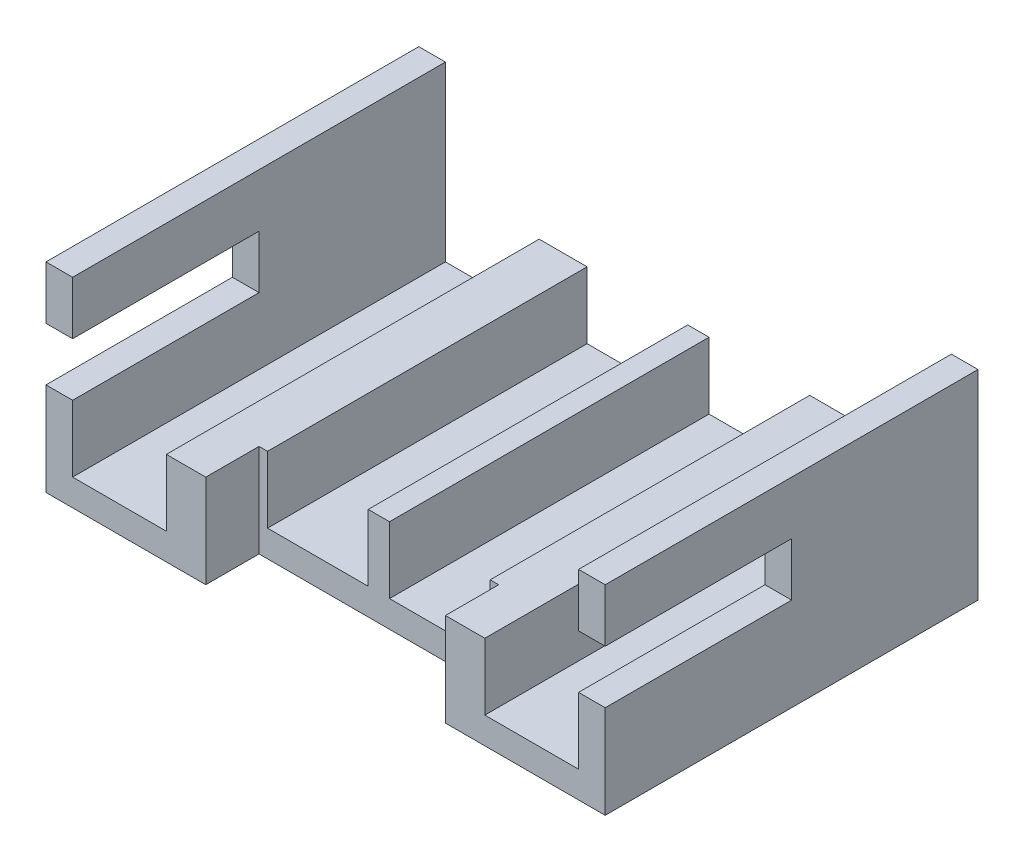
ISO-10303-21;
HEADER;
FILE_DESCRIPTION(('STEP AP214'),'2;1');
FILE_NAME('part.step','',(''),(''),'','','');
FILE_SCHEMA(('AUTOMOTIVE_DESIGN { 1 0 10303 214 1 1 1 1 }'));
ENDSEC;
DATA;
#1=APPLICATION_CONTEXT('core data for automotive mechanical design processes');
#2=APPLICATION_PROTOCOL_DEFINITION('international standard','automotive_design',2000,#1);
#3=PRODUCT_CONTEXT('',#1,'mechanical');
#4=PRODUCT('Part','Part','',(#3));
#5=PRODUCT_RELATED_PRODUCT_CATEGORY('part','',(#4));
#6=PRODUCT_DEFINITION_FORMATION('','',#4);
#7=PRODUCT_DEFINITION_CONTEXT('part definition',#1,'design');
#8=PRODUCT_DEFINITION('design','',#6,#7);
#9=PRODUCT_DEFINITION_SHAPE('','',#8);
#10=(LENGTH_UNIT() NAMED_UNIT(*) SI_UNIT(.MILLI.,.METRE.));
#11=(NAMED_UNIT(*) PLANE_ANGLE_UNIT() SI_UNIT($,.RADIAN.));
#12=(NAMED_UNIT(*) SI_UNIT($,.STERADIAN.) SOLID_ANGLE_UNIT());
#13=UNCERTAINTY_MEASURE_WITH_UNIT(LENGTH_MEASURE(1.E-05),#10,'distance_accuracy_value','');
#14=(GEOMETRIC_REPRESENTATION_CONTEXT(3) GLOBAL_UNCERTAINTY_ASSIGNED_CONTEXT((#13)) GLOBAL_UNIT_ASSIGNED_CONTEXT((#10,
#11,#12)) REPRESENTATION_CONTEXT('',''));
#15=CARTESIAN_POINT('',(0.,0.,0.));
#16=DIRECTION('',(0.,0.,1.));
#17=DIRECTION('',(1.,0.,0.));
#18=AXIS2_PLACEMENT_3D('',#15,#16,#17);
#19=CARTESIAN_POINT('',(-2.09,1.75,8.96786686541544));
#20=DIRECTION('',(0.,-1.,0.));
#21=DIRECTION('',(1.,0.,0.));
#22=AXIS2_PLACEMENT_3D('',#19,#20,#21);
#23=PLANE('',#22);
#24=DIRECTION('',(1.,0.,0.));
#25=VECTOR('',#24,1.);
#26=CARTESIAN_POINT('',(-2.09,1.75,0.));
#27=LINE('',#26,#25);
#28=CARTESIAN_POINT('',(-2.99,1.75,0.));
#29=VERTEX_POINT('',#28);
#30=CARTESIAN_POINT('',(-2.09,1.75,0.));
#31=VERTEX_POINT('',#30);
#32=EDGE_CURVE('E288',#29,#31,#27,.T.);
#33=ORIENTED_EDGE('',*,*,#32,.F.);
#34=DIRECTION('',(0.,0.,1.));
#35=VECTOR('',#34,1.);
#36=CARTESIAN_POINT('',(-2.99,1.75,8.96786686541544));
#37=LINE('',#36,#35);
#38=CARTESIAN_POINT('',(-2.99,1.75,7.));
#39=VERTEX_POINT('',#38);
#40=EDGE_CURVE('E261',#39,#29,#37,.F.);
#41=ORIENTED_EDGE('',*,*,#40,.F.);
#42=DIRECTION('',(1.,0.,0.));
#43=VECTOR('',#42,1.);
#44=CARTESIAN_POINT('',(-2.09,1.75,7.));
#45=LINE('',#44,#43);
#46=CARTESIAN_POINT('',(-2.25,1.75,7.));
#47=VERTEX_POINT('',#46);
#48=EDGE_CURVE('E224',#47,#39,#45,.F.);
#49=ORIENTED_EDGE('',*,*,#48,.F.);
#50=DIRECTION('',(0.,0.,1.));
#51=VECTOR('',#50,1.);
#52=CARTESIAN_POINT('',(-2.25,1.75,8.96786686541544));
#53=LINE('',#52,#51);
#54=CARTESIAN_POINT('',(-2.25,1.75,6.));
#55=VERTEX_POINT('',#54);
#56=EDGE_CURVE('E227',#55,#47,#53,.T.);
#57=ORIENTED_EDGE('',*,*,#56,.F.);
#58=DIRECTION('',(1.,0.,0.));
#59=VECTOR('',#58,1.);
#60=CARTESIAN_POINT('',(-2.09,1.75,6.));
#61=LINE('',#60,#59);
#62=CARTESIAN_POINT('',(-2.09,1.75,6.));
#63=VERTEX_POINT('',#62);
#64=EDGE_CURVE('E20',#63,#55,#61,.F.);
#65=ORIENTED_EDGE('',*,*,#64,.F.);
#66=DIRECTION('',(0.,0.,1.));
#67=VECTOR('',#66,1.);
#68=CARTESIAN_POINT('',(-2.09,1.75,8.96786686541544));
#69=LINE('',#68,#67);
#70=EDGE_CURVE('E246',#63,#31,#69,.F.);
#71=ORIENTED_EDGE('',*,*,#70,.T.);
#72=EDGE_LOOP('',(#33,#41,#49,#57,#65,#71));
#73=FACE_BOUND('',#72,.T.);
#74=ADVANCED_FACE('F17',(#73),#23,.F.);
#75=CARTESIAN_POINT('',(2.09,1.75,8.96786686541544));
#76=DIRECTION('',(0.,1.,0.));
#77=DIRECTION('',(-1.,0.,0.));
#78=AXIS2_PLACEMENT_3D('',#75,#76,#77);
#79=PLANE('',#78);
#80=DIRECTION('',(0.,0.,1.));
#81=VECTOR('',#80,1.);
#82=CARTESIAN_POINT('',(2.25,1.75,8.96786686541544));
#83=LINE('',#82,#81);
#84=CARTESIAN_POINT('',(2.25,1.75,6.));
#85=VERTEX_POINT('',#84);
#86=CARTESIAN_POINT('',(2.25,1.75,7.));
#87=VERTEX_POINT('',#86);
#88=EDGE_CURVE('E282',#85,#87,#83,.T.);
#89=ORIENTED_EDGE('',*,*,#88,.T.);
#90=DIRECTION('',(-1.,0.,0.));
#91=VECTOR('',#90,1.);
#92=CARTESIAN_POINT('',(2.09,1.75,7.));
#93=LINE('',#92,#91);
#94=CARTESIAN_POINT('',(2.99,1.75,7.));
#95=VERTEX_POINT('',#94);
#96=EDGE_CURVE('E280',#87,#95,#93,.F.);
#97=ORIENTED_EDGE('',*,*,#96,.T.);
#98=DIRECTION('',(0.,0.,1.));
#99=VECTOR('',#98,1.);
#100=CARTESIAN_POINT('',(2.99,1.75,8.96786686541544));
#101=LINE('',#100,#99);
#102=CARTESIAN_POINT('',(2.99,1.75,0.));
#103=VERTEX_POINT('',#102);
#104=EDGE_CURVE('E270',#95,#103,#101,.F.);
#105=ORIENTED_EDGE('',*,*,#104,.T.);
#106=DIRECTION('',(-1.,0.,0.));
#107=VECTOR('',#106,1.);
#108=CARTESIAN_POINT('',(2.09,1.75,0.));
#109=LINE('',#108,#107);
#110=CARTESIAN_POINT('',(2.09,1.75,0.));
#111=VERTEX_POINT('',#110);
#112=EDGE_CURVE('E286',#103,#111,#109,.T.);
#113=ORIENTED_EDGE('',*,*,#112,.T.);
#114=DIRECTION('',(0.,0.,1.));
#115=VECTOR('',#114,1.);
#116=CARTESIAN_POINT('',(2.09,1.75,8.96786686541544));
#117=LINE('',#116,#115);
#118=CARTESIAN_POINT('',(2.09,1.75,6.));
#119=VERTEX_POINT('',#118);
#120=EDGE_CURVE('E449',#119,#111,#117,.F.);
#121=ORIENTED_EDGE('',*,*,#120,.F.);
#122=DIRECTION('',(-1.,0.,0.));
#123=VECTOR('',#122,1.);
#124=CARTESIAN_POINT('',(2.09,1.75,6.));
#125=LINE('',#124,#123);
#126=EDGE_CURVE('E284',#119,#85,#125,.F.);
#127=ORIENTED_EDGE('',*,*,#126,.T.);
#128=EDGE_LOOP('',(#89,#97,#105,#113,#121,#127));
#129=FACE_BOUND('',#128,.T.);
#130=ADVANCED_FACE('F463',(#129),#79,.T.);
#131=CARTESIAN_POINT('',(-0.2,1.75,8.79513230710162));
#132=DIRECTION('',(0.,1.,0.));
#133=DIRECTION('',(0.,0.,1.));
#134=AXIS2_PLACEMENT_3D('',#131,#132,#133);
#135=PLANE('',#134);
#136=DIRECTION('',(0.,0.,1.));
#137=VECTOR('',#136,1.);
#138=CARTESIAN_POINT('',(-0.2,1.75,8.79513230710162));
#139=LINE('',#138,#137);
#140=CARTESIAN_POINT('',(-0.2,1.75,6.));
#141=VERTEX_POINT('',#140);
#142=CARTESIAN_POINT('',(-0.2,1.75,0.));
#143=VERTEX_POINT('',#142);
#144=EDGE_CURVE('E256',#141,#143,#139,.F.);
#145=ORIENTED_EDGE('',*,*,#144,.F.);
#146=DIRECTION('',(1.,0.,0.));
#147=VECTOR('',#146,1.);
#148=CARTESIAN_POINT('',(-0.2,1.75,6.));
#149=LINE('',#148,#147);
#150=CARTESIAN_POINT('',(0.2,1.75,6.));
#151=VERTEX_POINT('',#150);
#152=EDGE_CURVE('E276',#141,#151,#149,.T.);
#153=ORIENTED_EDGE('',*,*,#152,.T.);
#154=DIRECTION('',(0.,0.,1.));
#155=VECTOR('',#154,1.);
#156=CARTESIAN_POINT('',(0.2,1.75,8.79513230710162));
#157=LINE('',#156,#155);
#158=CARTESIAN_POINT('',(0.2,1.75,0.));
#159=VERTEX_POINT('',#158);
#160=EDGE_CURVE('E439',#151,#159,#157,.F.);
#161=ORIENTED_EDGE('',*,*,#160,.T.);
#162=DIRECTION('',(1.,0.,0.));
#163=VECTOR('',#162,1.);
#164=CARTESIAN_POINT('',(-0.2,1.75,0.));
#165=LINE('',#164,#163);
#166=EDGE_CURVE('E278',#159,#143,#165,.F.);
#167=ORIENTED_EDGE('',*,*,#166,.T.);
#168=EDGE_LOOP('',(#145,#153,#161,#167));
#169=FACE_BOUND('',#168,.T.);
#170=ADVANCED_FACE('F813',(#169),#135,.T.);
#171=CARTESIAN_POINT('',(2.99,0.,8.96786686541544));
#172=DIRECTION('',(-1.,0.,0.));
#173=DIRECTION('',(0.,-1.,0.));
#174=AXIS2_PLACEMENT_3D('',#171,#172,#173);
#175=PLANE('',#174);
#176=DIRECTION('',(0.,-1.,0.));
#177=VECTOR('',#176,1.);
#178=CARTESIAN_POINT('',(2.99,0.,0.));
#179=LINE('',#178,#177);
#180=CARTESIAN_POINT('',(2.99,0.5,0.));
#181=VERTEX_POINT('',#180);
#182=EDGE_CURVE('E268',#103,#181,#179,.T.);
#183=ORIENTED_EDGE('',*,*,#182,.F.);
#184=ORIENTED_EDGE('',*,*,#104,.F.);
#185=DIRECTION('',(0.,-1.,0.));
#186=VECTOR('',#185,1.);
#187=CARTESIAN_POINT('',(2.99,0.,7.));
#188=LINE('',#187,#186);
#189=CARTESIAN_POINT('',(2.99,0.5,7.));
#190=VERTEX_POINT('',#189);
#191=EDGE_CURVE('E273',#190,#95,#188,.F.);
#192=ORIENTED_EDGE('',*,*,#191,.F.);
#193=DIRECTION('',(0.,0.,1.));
#194=VECTOR('',#193,1.);
#195=CARTESIAN_POINT('',(2.99,0.500000000000001,7.));
#196=LINE('',#195,#194);
#197=EDGE_CURVE('E424',#181,#190,#196,.T.);
#198=ORIENTED_EDGE('',*,*,#197,.F.);
#199=EDGE_LOOP('',(#183,#184,#192,#198));
#200=FACE_BOUND('',#199,.T.);
#201=ADVANCED_FACE('F468',(#200),#175,.F.);
#202=CARTESIAN_POINT('',(-2.99,0.,8.96786686541544));
#203=DIRECTION('',(-1.,0.,0.));
#204=DIRECTION('',(0.,-1.,0.));
#205=AXIS2_PLACEMENT_3D('',#202,#203,#204);
#206=PLANE('',#205);
#207=DIRECTION('',(0.,-1.,0.));
#208=VECTOR('',#207,1.);
#209=CARTESIAN_POINT('',(-2.99,0.,7.));
#210=LINE('',#209,#208);
#211=CARTESIAN_POINT('',(-2.99,0.5,7.));
#212=VERTEX_POINT('',#211);
#213=EDGE_CURVE('E264',#212,#39,#210,.F.);
#214=ORIENTED_EDGE('',*,*,#213,.T.);
#215=ORIENTED_EDGE('',*,*,#40,.T.);
#216=DIRECTION('',(0.,-1.,0.));
#217=VECTOR('',#216,1.);
#218=CARTESIAN_POINT('',(-2.99,0.,0.));
#219=LINE('',#218,#217);
#220=CARTESIAN_POINT('',(-2.99,0.5,0.));
#221=VERTEX_POINT('',#220);
#222=EDGE_CURVE('E266',#29,#221,#219,.T.);
#223=ORIENTED_EDGE('',*,*,#222,.T.);
#224=DIRECTION('',(0.,0.,1.));
#225=VECTOR('',#224,1.);
#226=CARTESIAN_POINT('',(-2.99,0.5,7.));
#227=LINE('',#226,#225);
#228=EDGE_CURVE('E380',#212,#221,#227,.F.);
#229=ORIENTED_EDGE('',*,*,#228,.F.);
#230=EDGE_LOOP('',(#214,#215,#223,#229));
#231=FACE_BOUND('',#230,.T.);
#232=ADVANCED_FACE('F299',(#231),#206,.T.);
#233=CARTESIAN_POINT('',(-0.2,0.,8.79513230710162));
#234=DIRECTION('',(-1.,0.,0.));
#235=DIRECTION('',(0.,0.,1.));
#236=AXIS2_PLACEMENT_3D('',#233,#234,#235);
#237=PLANE('',#236);
#238=DIRECTION('',(0.,1.,0.));
#239=VECTOR('',#238,1.);
#240=CARTESIAN_POINT('',(-0.2,0.,0.));
#241=LINE('',#240,#239);
#242=CARTESIAN_POINT('',(-0.2,0.5,0.));
#243=VERTEX_POINT('',#242);
#244=EDGE_CURVE('E251',#143,#243,#241,.F.);
#245=ORIENTED_EDGE('',*,*,#244,.T.);
#246=DIRECTION('',(0.,0.,1.));
#247=VECTOR('',#246,1.);
#248=CARTESIAN_POINT('',(-0.2,0.5,7.));
#249=LINE('',#248,#247);
#250=CARTESIAN_POINT('',(-0.2,0.5,6.));
#251=VERTEX_POINT('',#250);
#252=EDGE_CURVE('E372',#251,#243,#249,.F.);
#253=ORIENTED_EDGE('',*,*,#252,.F.);
#254=DIRECTION('',(0.,1.,0.));
#255=VECTOR('',#254,1.);
#256=CARTESIAN_POINT('',(-0.2,0.,6.));
#257=LINE('',#256,#255);
#258=EDGE_CURVE('E259',#251,#141,#257,.T.);
#259=ORIENTED_EDGE('',*,*,#258,.T.);
#260=ORIENTED_EDGE('',*,*,#144,.T.);
#261=EDGE_LOOP('',(#245,#253,#259,#260));
#262=FACE_BOUND('',#261,.T.);
#263=ADVANCED_FACE('F790',(#262),#237,.T.);
#264=CARTESIAN_POINT('',(-2.09,0.,8.96786686541544));
#265=DIRECTION('',(-1.,0.,0.));
#266=DIRECTION('',(0.,-1.,0.));
#267=AXIS2_PLACEMENT_3D('',#264,#265,#266);
#268=PLANE('',#267);
#269=DIRECTION('',(0.,-1.,0.));
#270=VECTOR('',#269,1.);
#271=CARTESIAN_POINT('',(-2.09,0.,6.));
#272=LINE('',#271,#270);
#273=CARTESIAN_POINT('',(-2.09,0.5,6.));
#274=VERTEX_POINT('',#273);
#275=EDGE_CURVE('E241',#274,#63,#272,.F.);
#276=ORIENTED_EDGE('',*,*,#275,.F.);
#277=DIRECTION('',(0.,0.,1.));
#278=VECTOR('',#277,1.);
#279=CARTESIAN_POINT('',(-2.09,0.5,7.));
#280=LINE('',#279,#278);
#281=CARTESIAN_POINT('',(-2.09,0.5,0.));
#282=VERTEX_POINT('',#281);
#283=EDGE_CURVE('E370',#282,#274,#280,.T.);
#284=ORIENTED_EDGE('',*,*,#283,.F.);
#285=DIRECTION('',(0.,-1.,0.));
#286=VECTOR('',#285,1.);
#287=CARTESIAN_POINT('',(-2.09,0.,0.));
#288=LINE('',#287,#286);
#289=EDGE_CURVE('E247',#31,#282,#288,.T.);
#290=ORIENTED_EDGE('',*,*,#289,.F.);
#291=ORIENTED_EDGE('',*,*,#70,.F.);
#292=EDGE_LOOP('',(#276,#284,#290,#291));
#293=FACE_BOUND('',#292,.T.);
#294=ADVANCED_FACE('F782',(#293),#268,.F.);
#295=CARTESIAN_POINT('',(2.09,0.,8.96786686541544));
#296=DIRECTION('',(-1.,0.,0.));
#297=DIRECTION('',(0.,-1.,0.));
#298=AXIS2_PLACEMENT_3D('',#295,#296,#297);
#299=PLANE('',#298);
#300=DIRECTION('',(0.,-1.,0.));
#301=VECTOR('',#300,1.);
#302=CARTESIAN_POINT('',(2.09,0.,0.));
#303=LINE('',#302,#301);
#304=CARTESIAN_POINT('',(2.09,0.5,0.));
#305=VERTEX_POINT('',#304);
#306=EDGE_CURVE('E447',#111,#305,#303,.T.);
#307=ORIENTED_EDGE('',*,*,#306,.T.);
#308=DIRECTION('',(0.,0.,1.));
#309=VECTOR('',#308,1.);
#310=CARTESIAN_POINT('',(2.09,0.5,7.));
#311=LINE('',#310,#309);
#312=CARTESIAN_POINT('',(2.09,0.5,6.));
#313=VERTEX_POINT('',#312);
#314=EDGE_CURVE('E367',#313,#305,#311,.F.);
#315=ORIENTED_EDGE('',*,*,#314,.F.);
#316=DIRECTION('',(0.,-1.,0.));
#317=VECTOR('',#316,1.);
#318=CARTESIAN_POINT('',(2.09,0.,6.));
#319=LINE('',#318,#317);
#320=EDGE_CURVE('E249',#313,#119,#319,.F.);
#321=ORIENTED_EDGE('',*,*,#320,.T.);
#322=ORIENTED_EDGE('',*,*,#120,.T.);
#323=EDGE_LOOP('',(#307,#315,#321,#322));
#324=FACE_BOUND('',#323,.T.);
#325=ADVANCED_FACE('F454',(#324),#299,.T.);
#326=CARTESIAN_POINT('',(0.2,0.,8.79513230710162));
#327=DIRECTION('',(-1.,0.,0.));
#328=DIRECTION('',(0.,0.,1.));
#329=AXIS2_PLACEMENT_3D('',#326,#327,#328);
#330=PLANE('',#329);
#331=DIRECTION('',(0.,1.,0.));
#332=VECTOR('',#331,1.);
#333=CARTESIAN_POINT('',(0.2,0.,6.));
#334=LINE('',#333,#332);
#335=CARTESIAN_POINT('',(0.2,0.5,6.));
#336=VERTEX_POINT('',#335);
#337=EDGE_CURVE('E442',#336,#151,#334,.T.);
#338=ORIENTED_EDGE('',*,*,#337,.F.);
#339=DIRECTION('',(0.,0.,1.));
#340=VECTOR('',#339,1.);
#341=CARTESIAN_POINT('',(0.2,0.5,7.));
#342=LINE('',#341,#340);
#343=CARTESIAN_POINT('',(0.2,0.5,0.));
#344=VERTEX_POINT('',#343);
#345=EDGE_CURVE('E364',#344,#336,#342,.T.);
#346=ORIENTED_EDGE('',*,*,#345,.F.);
#347=DIRECTION('',(0.,1.,0.));
#348=VECTOR('',#347,1.);
#349=CARTESIAN_POINT('',(0.2,0.,0.));
#350=LINE('',#349,#348);
#351=EDGE_CURVE('E445',#159,#344,#350,.F.);
#352=ORIENTED_EDGE('',*,*,#351,.F.);
#353=ORIENTED_EDGE('',*,*,#160,.F.);
#354=EDGE_LOOP('',(#338,#346,#352,#353));
#355=FACE_BOUND('',#354,.T.);
#356=ADVANCED_FACE('F766',(#355),#330,.F.);
#357=CARTESIAN_POINT('',(4.75,3.75,7.));
#358=DIRECTION('',(0.,1.,0.));
#359=DIRECTION('',(0.,0.,1.));
#360=AXIS2_PLACEMENT_3D('',#357,#358,#359);
#361=PLANE('',#360);
#362=DIRECTION('',(-1.,0.,0.));
#363=VECTOR('',#362,1.);
#364=CARTESIAN_POINT('',(5.25,3.75,7.));
#365=LINE('',#364,#363);
#366=CARTESIAN_POINT('',(4.75,3.75,7.));
#367=VERTEX_POINT('',#366);
#368=CARTESIAN_POINT('',(5.25,3.75,7.));
#369=VERTEX_POINT('',#368);
#370=EDGE_CURVE('E430',#367,#369,#365,.F.);
#371=ORIENTED_EDGE('',*,*,#370,.T.);
#372=DIRECTION('',(0.,0.,1.));
#373=VECTOR('',#372,1.);
#374=CARTESIAN_POINT('',(5.25,3.75,7.));
#375=LINE('',#374,#373);
#376=CARTESIAN_POINT('',(5.25,3.75,0.));
#377=VERTEX_POINT('',#376);
#378=EDGE_CURVE('E350',#369,#377,#375,.F.);
#379=ORIENTED_EDGE('',*,*,#378,.T.);
#380=DIRECTION('',(1.,0.,0.));
#381=VECTOR('',#380,1.);
#382=CARTESIAN_POINT('',(4.75,3.75,0.));
#383=LINE('',#382,#381);
#384=CARTESIAN_POINT('',(4.75,3.75,0.));
#385=VERTEX_POINT('',#384);
#386=EDGE_CURVE('E437',#377,#385,#383,.F.);
#387=ORIENTED_EDGE('',*,*,#386,.T.);
#388=DIRECTION('',(0.,0.,1.));
#389=VECTOR('',#388,1.);
#390=CARTESIAN_POINT('',(4.75,3.75,7.));
#391=LINE('',#390,#389);
#392=EDGE_CURVE('E416',#367,#385,#391,.F.);
#393=ORIENTED_EDGE('',*,*,#392,.F.);
#394=EDGE_LOOP('',(#371,#379,#387,#393));
#395=FACE_BOUND('',#394,.T.);
#396=ADVANCED_FACE('F481',(#395),#361,.T.);
#397=CARTESIAN_POINT('',(-5.25,1.75,3.5));
#398=DIRECTION('',(0.,-1.,0.));
#399=DIRECTION('',(0.,0.,-1.));
#400=AXIS2_PLACEMENT_3D('',#397,#398,#399);
#401=PLANE('',#400);
#402=DIRECTION('',(-1.,0.,0.));
#403=VECTOR('',#402,1.);
#404=CARTESIAN_POINT('',(5.25,1.75,7.));
#405=LINE('',#404,#403);
#406=CARTESIAN_POINT('',(4.75,1.75,7.));
#407=VERTEX_POINT('',#406);
#408=CARTESIAN_POINT('',(5.25,1.75,7.));
#409=VERTEX_POINT('',#408);
#410=EDGE_CURVE('E353',#407,#409,#405,.F.);
#411=ORIENTED_EDGE('',*,*,#410,.T.);
#412=DIRECTION('',(0.,0.,1.));
#413=VECTOR('',#412,1.);
#414=CARTESIAN_POINT('',(5.25,1.75,7.));
#415=LINE('',#414,#413);
#416=CARTESIAN_POINT('',(5.25,1.75,3.5));
#417=VERTEX_POINT('',#416);
#418=EDGE_CURVE('E344',#409,#417,#415,.F.);
#419=ORIENTED_EDGE('',*,*,#418,.T.);
#420=DIRECTION('',(1.,0.,0.));
#421=VECTOR('',#420,1.);
#422=CARTESIAN_POINT('',(-5.25,1.75,3.5));
#423=LINE('',#422,#421);
#424=CARTESIAN_POINT('',(4.75,1.75,3.5));
#425=VERTEX_POINT('',#424);
#426=EDGE_CURVE('E435',#425,#417,#423,.T.);
#427=ORIENTED_EDGE('',*,*,#426,.F.);
#428=DIRECTION('',(0.,0.,1.));
#429=VECTOR('',#428,1.);
#430=CARTESIAN_POINT('',(4.75,1.75,7.));
#431=LINE('',#430,#429);
#432=EDGE_CURVE('E412',#407,#425,#431,.F.);
#433=ORIENTED_EDGE('',*,*,#432,.F.);
#434=EDGE_LOOP('',(#411,#419,#427,#433));
#435=FACE_BOUND('',#434,.T.);
#436=ADVANCED_FACE('F749',(#435),#401,.F.);
#437=CARTESIAN_POINT('',(-5.25,1.75,3.5));
#438=DIRECTION('',(0.,0.,1.));
#439=DIRECTION('',(1.,0.,0.));
#440=AXIS2_PLACEMENT_3D('',#437,#438,#439);
#441=PLANE('',#440);
#442=DIRECTION('',(1.,0.,0.));
#443=VECTOR('',#442,1.);
#444=CARTESIAN_POINT('',(-5.25,2.75,3.5));
#445=LINE('',#444,#443);
#446=CARTESIAN_POINT('',(5.25,2.75,3.5));
#447=VERTEX_POINT('',#446);
#448=CARTESIAN_POINT('',(4.75,2.75,3.5));
#449=VERTEX_POINT('',#448);
#450=EDGE_CURVE('E433',#447,#449,#445,.F.);
#451=ORIENTED_EDGE('',*,*,#450,.T.);
#452=DIRECTION('',(0.,1.,0.));
#453=VECTOR('',#452,1.);
#454=CARTESIAN_POINT('',(4.75,0.,3.5));
#455=LINE('',#454,#453);
#456=EDGE_CURVE('E409',#425,#449,#455,.T.);
#457=ORIENTED_EDGE('',*,*,#456,.F.);
#458=ORIENTED_EDGE('',*,*,#426,.T.);
#459=DIRECTION('',(0.,1.,0.));
#460=VECTOR('',#459,1.);
#461=CARTESIAN_POINT('',(5.25,0.,3.5));
#462=LINE('',#461,#460);
#463=EDGE_CURVE('E341',#417,#447,#462,.T.);
#464=ORIENTED_EDGE('',*,*,#463,.T.);
#465=EDGE_LOOP('',(#451,#457,#458,#464));
#466=FACE_BOUND('',#465,.T.);
#467=ADVANCED_FACE('F740',(#466),#441,.T.);
#468=CARTESIAN_POINT('',(-5.25,2.75,3.5));
#469=DIRECTION('',(0.,1.,0.));
#470=DIRECTION('',(0.,0.,1.));
#471=AXIS2_PLACEMENT_3D('',#468,#469,#470);
#472=PLANE('',#471);
#473=ORIENTED_EDGE('',*,*,#450,.F.);
#474=DIRECTION('',(0.,0.,1.));
#475=VECTOR('',#474,1.);
#476=CARTESIAN_POINT('',(5.25,2.75,7.));
#477=LINE('',#476,#475);
#478=CARTESIAN_POINT('',(5.25,2.75,7.));
#479=VERTEX_POINT('',#478);
#480=EDGE_CURVE('E338',#447,#479,#477,.T.);
#481=ORIENTED_EDGE('',*,*,#480,.T.);
#482=DIRECTION('',(-1.,0.,0.));
#483=VECTOR('',#482,1.);
#484=CARTESIAN_POINT('',(5.25,2.75,7.));
#485=LINE('',#484,#483);
#486=CARTESIAN_POINT('',(4.75,2.75,7.));
#487=VERTEX_POINT('',#486);
#488=EDGE_CURVE('E427',#479,#487,#485,.T.);
#489=ORIENTED_EDGE('',*,*,#488,.T.);
#490=DIRECTION('',(0.,0.,1.));
#491=VECTOR('',#490,1.);
#492=CARTESIAN_POINT('',(4.75,2.75,7.));
#493=LINE('',#492,#491);
#494=EDGE_CURVE('E422',#449,#487,#493,.T.);
#495=ORIENTED_EDGE('',*,*,#494,.F.);
#496=EDGE_LOOP('',(#473,#481,#489,#495));
#497=FACE_BOUND('',#496,.T.);
#498=ADVANCED_FACE('F731',(#497),#472,.F.);
#499=CARTESIAN_POINT('',(5.25,3.75,7.));
#500=DIRECTION('',(0.,0.,-1.));
#501=DIRECTION('',(-1.,0.,0.));
#502=AXIS2_PLACEMENT_3D('',#499,#500,#501);
#503=PLANE('',#502);
#504=ORIENTED_EDGE('',*,*,#488,.F.);
#505=DIRECTION('',(0.,1.,0.));
#506=VECTOR('',#505,1.);
#507=CARTESIAN_POINT('',(5.25,0.,7.));
#508=LINE('',#507,#506);
#509=EDGE_CURVE('E335',#479,#369,#508,.T.);
#510=ORIENTED_EDGE('',*,*,#509,.T.);
#511=ORIENTED_EDGE('',*,*,#370,.F.);
#512=DIRECTION('',(0.,1.,0.));
#513=VECTOR('',#512,1.);
#514=CARTESIAN_POINT('',(4.75,0.,7.));
#515=LINE('',#514,#513);
#516=EDGE_CURVE('E419',#487,#367,#515,.T.);
#517=ORIENTED_EDGE('',*,*,#516,.F.);
#518=EDGE_LOOP('',(#504,#510,#511,#517));
#519=FACE_BOUND('',#518,.T.);
#520=ADVANCED_FACE('F723',(#519),#503,.F.);
#521=CARTESIAN_POINT('',(-5.25,0.5,7.));
#522=DIRECTION('',(0.,1.,0.));
#523=DIRECTION('',(-1.,0.,0.));
#524=AXIS2_PLACEMENT_3D('',#521,#522,#523);
#525=PLANE('',#524);
#526=DIRECTION('',(-1.,0.,0.));
#527=VECTOR('',#526,1.);
#528=CARTESIAN_POINT('',(5.25,0.5,7.));
#529=LINE('',#528,#527);
#530=CARTESIAN_POINT('',(4.75,0.500000000000001,7.));
#531=VERTEX_POINT('',#530);
#532=EDGE_CURVE('E358',#190,#531,#529,.F.);
#533=ORIENTED_EDGE('',*,*,#532,.T.);
#534=DIRECTION('',(0.,0.,1.));
#535=VECTOR('',#534,1.);
#536=CARTESIAN_POINT('',(4.75,0.500000000000001,7.));
#537=LINE('',#536,#535);
#538=CARTESIAN_POINT('',(4.75,0.500000000000001,0.));
#539=VERTEX_POINT('',#538);
#540=EDGE_CURVE('E414',#539,#531,#537,.T.);
#541=ORIENTED_EDGE('',*,*,#540,.F.);
#542=DIRECTION('',(-1.,0.,0.));
#543=VECTOR('',#542,1.);
#544=CARTESIAN_POINT('',(5.25,0.5,0.));
#545=LINE('',#544,#543);
#546=EDGE_CURVE('E327',#181,#539,#545,.F.);
#547=ORIENTED_EDGE('',*,*,#546,.F.);
#548=ORIENTED_EDGE('',*,*,#197,.T.);
#549=EDGE_LOOP('',(#533,#541,#547,#548));
#550=FACE_BOUND('',#549,.T.);
#551=ADVANCED_FACE('F473',(#550),#525,.T.);
#552=CARTESIAN_POINT('',(4.75,0.,7.));
#553=DIRECTION('',(-1.,0.,0.));
#554=DIRECTION('',(0.,0.,1.));
#555=AXIS2_PLACEMENT_3D('',#552,#553,#554);
#556=PLANE('',#555);
#557=ORIENTED_EDGE('',*,*,#432,.T.);
#558=ORIENTED_EDGE('',*,*,#456,.T.);
#559=ORIENTED_EDGE('',*,*,#494,.T.);
#560=ORIENTED_EDGE('',*,*,#516,.T.);
#561=ORIENTED_EDGE('',*,*,#392,.T.);
#562=DIRECTION('',(0.,1.,0.));
#563=VECTOR('',#562,1.);
#564=CARTESIAN_POINT('',(4.75,3.75,0.));
#565=LINE('',#564,#563);
#566=EDGE_CURVE('E324',#539,#385,#565,.T.);
#567=ORIENTED_EDGE('',*,*,#566,.F.);
#568=ORIENTED_EDGE('',*,*,#540,.T.);
#569=DIRECTION('',(0.,1.,0.));
#570=VECTOR('',#569,1.);
#571=CARTESIAN_POINT('',(4.75,3.75,7.));
#572=LINE('',#571,#570);
#573=EDGE_CURVE('E355',#531,#407,#572,.T.);
#574=ORIENTED_EDGE('',*,*,#573,.T.);
#575=EDGE_LOOP('',(#557,#558,#559,#560,#561,#567,#568,#574));
#576=FACE_BOUND('',#575,.T.);
#577=ADVANCED_FACE('F476',(#576),#556,.T.);
#578=CARTESIAN_POINT('',(-4.75,3.75,7.));
#579=DIRECTION('',(1.,0.,0.));
#580=DIRECTION('',(0.,0.,-1.));
#581=AXIS2_PLACEMENT_3D('',#578,#579,#580);
#582=PLANE('',#581);
#583=DIRECTION('',(0.,0.,1.));
#584=VECTOR('',#583,1.);
#585=CARTESIAN_POINT('',(-4.75,3.75,7.));
#586=LINE('',#585,#584);
#587=CARTESIAN_POINT('',(-4.75,3.75,7.));
#588=VERTEX_POINT('',#587);
#589=CARTESIAN_POINT('',(-4.75,3.75,0.));
#590=VERTEX_POINT('',#589);
#591=EDGE_CURVE('E400',#588,#590,#586,.F.);
#592=ORIENTED_EDGE('',*,*,#591,.F.);
#593=DIRECTION('',(0.,1.,0.));
#594=VECTOR('',#593,1.);
#595=CARTESIAN_POINT('',(-4.75,3.75,7.));
#596=LINE('',#595,#594);
#597=CARTESIAN_POINT('',(-4.75,2.75,7.));
#598=VERTEX_POINT('',#597);
#599=EDGE_CURVE('E395',#588,#598,#596,.F.);
#600=ORIENTED_EDGE('',*,*,#599,.T.);
#601=DIRECTION('',(0.,0.,1.));
#602=VECTOR('',#601,1.);
#603=CARTESIAN_POINT('',(-4.75,2.75,3.5));
#604=LINE('',#603,#602);
#605=CARTESIAN_POINT('',(-4.75,2.75,3.5));
#606=VERTEX_POINT('',#605);
#607=EDGE_CURVE('E390',#598,#606,#604,.F.);
#608=ORIENTED_EDGE('',*,*,#607,.T.);
#609=DIRECTION('',(0.,1.,0.));
#610=VECTOR('',#609,1.);
#611=CARTESIAN_POINT('',(-4.75,1.75,3.5));
#612=LINE('',#611,#610);
#613=CARTESIAN_POINT('',(-4.75,1.75,3.5));
#614=VERTEX_POINT('',#613);
#615=EDGE_CURVE('E382',#614,#606,#612,.T.);
#616=ORIENTED_EDGE('',*,*,#615,.F.);
#617=DIRECTION('',(0.,0.,-1.));
#618=VECTOR('',#617,1.);
#619=CARTESIAN_POINT('',(-4.75,1.75,3.5));
#620=LINE('',#619,#618);
#621=CARTESIAN_POINT('',(-4.75,1.75,7.));
#622=VERTEX_POINT('',#621);
#623=EDGE_CURVE('E402',#614,#622,#620,.F.);
#624=ORIENTED_EDGE('',*,*,#623,.T.);
#625=DIRECTION('',(0.,1.,0.));
#626=VECTOR('',#625,1.);
#627=CARTESIAN_POINT('',(-4.75,3.75,7.));
#628=LINE('',#627,#626);
#629=CARTESIAN_POINT('',(-4.75,0.5,7.));
#630=VERTEX_POINT('',#629);
#631=EDGE_CURVE('E407',#622,#630,#628,.F.);
#632=ORIENTED_EDGE('',*,*,#631,.T.);
#633=DIRECTION('',(0.,0.,1.));
#634=VECTOR('',#633,1.);
#635=CARTESIAN_POINT('',(-4.75,0.5,7.));
#636=LINE('',#635,#634);
#637=CARTESIAN_POINT('',(-4.75,0.5,0.));
#638=VERTEX_POINT('',#637);
#639=EDGE_CURVE('E378',#638,#630,#636,.T.);
#640=ORIENTED_EDGE('',*,*,#639,.F.);
#641=DIRECTION('',(0.,1.,0.));
#642=VECTOR('',#641,1.);
#643=CARTESIAN_POINT('',(-4.75,3.75,0.));
#644=LINE('',#643,#642);
#645=EDGE_CURVE('E308',#590,#638,#644,.F.);
#646=ORIENTED_EDGE('',*,*,#645,.F.);
#647=EDGE_LOOP('',(#592,#600,#608,#616,#624,#632,#640,#646));
#648=FACE_BOUND('',#647,.T.);
#649=ADVANCED_FACE('F540',(#648),#582,.T.);
#650=CARTESIAN_POINT('',(-5.25,1.75,3.5));
#651=DIRECTION('',(0.,-1.,0.));
#652=DIRECTION('',(0.,0.,-1.));
#653=AXIS2_PLACEMENT_3D('',#650,#651,#652);
#654=PLANE('',#653);
#655=DIRECTION('',(1.,0.,0.));
#656=VECTOR('',#655,1.);
#657=CARTESIAN_POINT('',(-5.25,1.75,3.5));
#658=LINE('',#657,#656);
#659=CARTESIAN_POINT('',(-5.25,1.75,3.5));
#660=VERTEX_POINT('',#659);
#661=EDGE_CURVE('E385',#660,#614,#658,.T.);
#662=ORIENTED_EDGE('',*,*,#661,.F.);
#663=DIRECTION('',(0.,0.,-1.));
#664=VECTOR('',#663,1.);
#665=CARTESIAN_POINT('',(-5.25,1.75,7.));
#666=LINE('',#665,#664);
#667=CARTESIAN_POINT('',(-5.25,1.75,7.));
#668=VERTEX_POINT('',#667);
#669=EDGE_CURVE('E312',#660,#668,#666,.F.);
#670=ORIENTED_EDGE('',*,*,#669,.T.);
#671=DIRECTION('',(1.,0.,0.));
#672=VECTOR('',#671,1.);
#673=CARTESIAN_POINT('',(-5.25,1.75,7.));
#674=LINE('',#673,#672);
#675=EDGE_CURVE('E405',#622,#668,#674,.F.);
#676=ORIENTED_EDGE('',*,*,#675,.F.);
#677=ORIENTED_EDGE('',*,*,#623,.F.);
#678=EDGE_LOOP('',(#662,#670,#676,#677));
#679=FACE_BOUND('',#678,.T.);
#680=ADVANCED_FACE('F554',(#679),#654,.F.);
#681=CARTESIAN_POINT('',(-5.25,3.75,7.));
#682=DIRECTION('',(0.,1.,0.));
#683=DIRECTION('',(0.,0.,1.));
#684=AXIS2_PLACEMENT_3D('',#681,#682,#683);
#685=PLANE('',#684);
#686=DIRECTION('',(-1.,0.,0.));
#687=VECTOR('',#686,1.);
#688=CARTESIAN_POINT('',(5.25,3.75,7.));
#689=LINE('',#688,#687);
#690=CARTESIAN_POINT('',(-5.25,3.75,7.));
#691=VERTEX_POINT('',#690);
#692=EDGE_CURVE('E397',#691,#588,#689,.F.);
#693=ORIENTED_EDGE('',*,*,#692,.T.);
#694=ORIENTED_EDGE('',*,*,#591,.T.);
#695=DIRECTION('',(-1.,0.,0.));
#696=VECTOR('',#695,1.);
#697=CARTESIAN_POINT('',(5.25,3.75,0.));
#698=LINE('',#697,#696);
#699=CARTESIAN_POINT('',(-5.25,3.75,0.));
#700=VERTEX_POINT('',#699);
#701=EDGE_CURVE('E317',#700,#590,#698,.F.);
#702=ORIENTED_EDGE('',*,*,#701,.F.);
#703=DIRECTION('',(0.,0.,-1.));
#704=VECTOR('',#703,1.);
#705=CARTESIAN_POINT('',(-5.25,3.75,7.));
#706=LINE('',#705,#704);
#707=EDGE_CURVE('E529',#700,#691,#706,.F.);
#708=ORIENTED_EDGE('',*,*,#707,.T.);
#709=EDGE_LOOP('',(#693,#694,#702,#708));
#710=FACE_BOUND('',#709,.T.);
#711=ADVANCED_FACE('F537',(#710),#685,.T.);
#712=CARTESIAN_POINT('',(5.25,3.75,7.));
#713=DIRECTION('',(0.,0.,-1.));
#714=DIRECTION('',(-1.,0.,0.));
#715=AXIS2_PLACEMENT_3D('',#712,#713,#714);
#716=PLANE('',#715);
#717=DIRECTION('',(1.,0.,0.));
#718=VECTOR('',#717,1.);
#719=CARTESIAN_POINT('',(-5.25,2.75,7.));
#720=LINE('',#719,#718);
#721=CARTESIAN_POINT('',(-5.25,2.75,7.));
#722=VERTEX_POINT('',#721);
#723=EDGE_CURVE('E392',#722,#598,#720,.T.);
#724=ORIENTED_EDGE('',*,*,#723,.T.);
#725=ORIENTED_EDGE('',*,*,#599,.F.);
#726=ORIENTED_EDGE('',*,*,#692,.F.);
#727=DIRECTION('',(0.,1.,0.));
#728=VECTOR('',#727,1.);
#729=CARTESIAN_POINT('',(-5.25,3.75,7.));
#730=LINE('',#729,#728);
#731=EDGE_CURVE('E526',#691,#722,#730,.F.);
#732=ORIENTED_EDGE('',*,*,#731,.T.);
#733=EDGE_LOOP('',(#724,#725,#726,#732));
#734=FACE_BOUND('',#733,.T.);
#735=ADVANCED_FACE('F543',(#734),#716,.F.);
#736=CARTESIAN_POINT('',(-5.25,2.75,3.5));
#737=DIRECTION('',(0.,1.,0.));
#738=DIRECTION('',(0.,0.,1.));
#739=AXIS2_PLACEMENT_3D('',#736,#737,#738);
#740=PLANE('',#739);
#741=DIRECTION('',(1.,0.,0.));
#742=VECTOR('',#741,1.);
#743=CARTESIAN_POINT('',(-5.25,2.75,3.5));
#744=LINE('',#743,#742);
#745=CARTESIAN_POINT('',(-5.25,2.75,3.5));
#746=VERTEX_POINT('',#745);
#747=EDGE_CURVE('E388',#606,#746,#744,.F.);
#748=ORIENTED_EDGE('',*,*,#747,.F.);
#749=ORIENTED_EDGE('',*,*,#607,.F.);
#750=ORIENTED_EDGE('',*,*,#723,.F.);
#751=DIRECTION('',(0.,0.,-1.));
#752=VECTOR('',#751,1.);
#753=CARTESIAN_POINT('',(-5.25,2.75,7.));
#754=LINE('',#753,#752);
#755=EDGE_CURVE('E523',#722,#746,#754,.T.);
#756=ORIENTED_EDGE('',*,*,#755,.T.);
#757=EDGE_LOOP('',(#748,#749,#750,#756));
#758=FACE_BOUND('',#757,.T.);
#759=ADVANCED_FACE('F546',(#758),#740,.F.);
#760=CARTESIAN_POINT('',(-5.25,1.75,3.5));
#761=DIRECTION('',(0.,0.,1.));
#762=DIRECTION('',(1.,0.,0.));
#763=AXIS2_PLACEMENT_3D('',#760,#761,#762);
#764=PLANE('',#763);
#765=ORIENTED_EDGE('',*,*,#661,.T.);
#766=ORIENTED_EDGE('',*,*,#615,.T.);
#767=ORIENTED_EDGE('',*,*,#747,.T.);
#768=DIRECTION('',(0.,1.,0.));
#769=VECTOR('',#768,1.);
#770=CARTESIAN_POINT('',(-5.25,3.75,3.5));
#771=LINE('',#770,#769);
#772=EDGE_CURVE('E520',#746,#660,#771,.F.);
#773=ORIENTED_EDGE('',*,*,#772,.T.);
#774=EDGE_LOOP('',(#765,#766,#767,#773));
#775=FACE_BOUND('',#774,.T.);
#776=ADVANCED_FACE('F550',(#775),#764,.T.);
#777=CARTESIAN_POINT('',(-5.25,0.5,7.));
#778=DIRECTION('',(0.,1.,0.));
#779=DIRECTION('',(-1.,0.,0.));
#780=AXIS2_PLACEMENT_3D('',#777,#778,#779);
#781=PLANE('',#780);
#782=ORIENTED_EDGE('',*,*,#639,.T.);
#783=DIRECTION('',(-1.,0.,0.));
#784=VECTOR('',#783,1.);
#785=CARTESIAN_POINT('',(5.25,0.5,7.));
#786=LINE('',#785,#784);
#787=EDGE_CURVE('E517',#630,#212,#786,.F.);
#788=ORIENTED_EDGE('',*,*,#787,.T.);
#789=ORIENTED_EDGE('',*,*,#228,.T.);
#790=DIRECTION('',(-1.,0.,0.));
#791=VECTOR('',#790,1.);
#792=CARTESIAN_POINT('',(5.25,0.5,0.));
#793=LINE('',#792,#791);
#794=EDGE_CURVE('E305',#638,#221,#793,.F.);
#795=ORIENTED_EDGE('',*,*,#794,.F.);
#796=EDGE_LOOP('',(#782,#788,#789,#795));
#797=FACE_BOUND('',#796,.T.);
#798=ADVANCED_FACE('F555',(#797),#781,.T.);
#799=CARTESIAN_POINT('',(2.25,3.75,7.));
#800=DIRECTION('',(1.,0.,0.));
#801=DIRECTION('',(0.,0.,-1.));
#802=AXIS2_PLACEMENT_3D('',#799,#800,#801);
#803=PLANE('',#802);
#804=DIRECTION('',(0.,1.,0.));
#805=VECTOR('',#804,1.);
#806=CARTESIAN_POINT('',(2.25,3.75,6.));
#807=LINE('',#806,#805);
#808=CARTESIAN_POINT('',(2.25,0.,6.));
#809=VERTEX_POINT('',#808);
#810=EDGE_CURVE('E236',#85,#809,#807,.F.);
#811=ORIENTED_EDGE('',*,*,#810,.T.);
#812=DIRECTION('',(0.,0.,-1.));
#813=VECTOR('',#812,1.);
#814=CARTESIAN_POINT('',(2.25,0.,7.));
#815=LINE('',#814,#813);
#816=CARTESIAN_POINT('',(2.25,0.,7.));
#817=VERTEX_POINT('',#816);
#818=EDGE_CURVE('E376',#817,#809,#815,.T.);
#819=ORIENTED_EDGE('',*,*,#818,.F.);
#820=DIRECTION('',(0.,1.,0.));
#821=VECTOR('',#820,1.);
#822=CARTESIAN_POINT('',(2.25,3.75,7.));
#823=LINE('',#822,#821);
#824=EDGE_CURVE('E361',#817,#87,#823,.T.);
#825=ORIENTED_EDGE('',*,*,#824,.T.);
#826=ORIENTED_EDGE('',*,*,#88,.F.);
#827=EDGE_LOOP('',(#811,#819,#825,#826));
#828=FACE_BOUND('',#827,.T.);
#829=ADVANCED_FACE('F557',(#828),#803,.F.);
#830=CARTESIAN_POINT('',(-2.25,3.75,7.));
#831=DIRECTION('',(-1.,0.,0.));
#832=DIRECTION('',(0.,0.,1.));
#833=AXIS2_PLACEMENT_3D('',#830,#831,#832);
#834=PLANE('',#833);
#835=DIRECTION('',(0.,0.,1.));
#836=VECTOR('',#835,1.);
#837=CARTESIAN_POINT('',(-2.25,0.,7.));
#838=LINE('',#837,#836);
#839=CARTESIAN_POINT('',(-2.25,0.,6.));
#840=VERTEX_POINT('',#839);
#841=CARTESIAN_POINT('',(-2.25,0.,7.));
#842=VERTEX_POINT('',#841);
#843=EDGE_CURVE('E35',#840,#842,#838,.T.);
#844=ORIENTED_EDGE('',*,*,#843,.F.);
#845=DIRECTION('',(0.,1.,0.));
#846=VECTOR('',#845,1.);
#847=CARTESIAN_POINT('',(-2.25,3.75,6.));
#848=LINE('',#847,#846);
#849=EDGE_CURVE('E231',#840,#55,#848,.T.);
#850=ORIENTED_EDGE('',*,*,#849,.T.);
#851=ORIENTED_EDGE('',*,*,#56,.T.);
#852=DIRECTION('',(0.,1.,0.));
#853=VECTOR('',#852,1.);
#854=CARTESIAN_POINT('',(-2.25,3.75,7.));
#855=LINE('',#854,#853);
#856=EDGE_CURVE('E296',#47,#842,#855,.F.);
#857=ORIENTED_EDGE('',*,*,#856,.T.);
#858=EDGE_LOOP('',(#844,#850,#851,#857));
#859=FACE_BOUND('',#858,.T.);
#860=ADVANCED_FACE('F232',(#859),#834,.F.);
#861=CARTESIAN_POINT('',(-5.25,0.5,7.));
#862=DIRECTION('',(0.,1.,0.));
#863=DIRECTION('',(-1.,0.,0.));
#864=AXIS2_PLACEMENT_3D('',#861,#862,#863);
#865=PLANE('',#864);
#866=DIRECTION('',(-1.,0.,0.));
#867=VECTOR('',#866,1.);
#868=CARTESIAN_POINT('',(5.25,0.5,0.));
#869=LINE('',#868,#867);
#870=EDGE_CURVE('E332',#282,#243,#869,.F.);
#871=ORIENTED_EDGE('',*,*,#870,.F.);
#872=ORIENTED_EDGE('',*,*,#283,.T.);
#873=DIRECTION('',(-1.,0.,0.));
#874=VECTOR('',#873,1.);
#875=CARTESIAN_POINT('',(-2.25,0.5,6.));
#876=LINE('',#875,#874);
#877=EDGE_CURVE('E235',#274,#251,#876,.F.);
#878=ORIENTED_EDGE('',*,*,#877,.T.);
#879=ORIENTED_EDGE('',*,*,#252,.T.);
#880=EDGE_LOOP('',(#871,#872,#878,#879));
#881=FACE_BOUND('',#880,.T.);
#882=ADVANCED_FACE('F589',(#881),#865,.T.);
#883=CARTESIAN_POINT('',(-5.25,0.5,7.));
#884=DIRECTION('',(0.,1.,0.));
#885=DIRECTION('',(-1.,0.,0.));
#886=AXIS2_PLACEMENT_3D('',#883,#884,#885);
#887=PLANE('',#886);
#888=DIRECTION('',(-1.,0.,0.));
#889=VECTOR('',#888,1.);
#890=CARTESIAN_POINT('',(5.25,0.5,0.));
#891=LINE('',#890,#889);
#892=EDGE_CURVE('E329',#344,#305,#891,.F.);
#893=ORIENTED_EDGE('',*,*,#892,.F.);
#894=ORIENTED_EDGE('',*,*,#345,.T.);
#895=DIRECTION('',(-1.,0.,0.));
#896=VECTOR('',#895,1.);
#897=CARTESIAN_POINT('',(-2.25,0.5,6.));
#898=LINE('',#897,#896);
#899=EDGE_CURVE('E509',#336,#313,#898,.F.);
#900=ORIENTED_EDGE('',*,*,#899,.T.);
#901=ORIENTED_EDGE('',*,*,#314,.T.);
#902=EDGE_LOOP('',(#893,#894,#900,#901));
#903=FACE_BOUND('',#902,.T.);
#904=ADVANCED_FACE('F585',(#903),#887,.T.);
#905=CARTESIAN_POINT('',(5.25,3.75,7.));
#906=DIRECTION('',(0.,0.,-1.));
#907=DIRECTION('',(-1.,0.,0.));
#908=AXIS2_PLACEMENT_3D('',#905,#906,#907);
#909=PLANE('',#908);
#910=ORIENTED_EDGE('',*,*,#410,.F.);
#911=ORIENTED_EDGE('',*,*,#573,.F.);
#912=ORIENTED_EDGE('',*,*,#532,.F.);
#913=ORIENTED_EDGE('',*,*,#191,.T.);
#914=ORIENTED_EDGE('',*,*,#96,.F.);
#915=ORIENTED_EDGE('',*,*,#824,.F.);
#916=DIRECTION('',(-1.,0.,0.));
#917=VECTOR('',#916,1.);
#918=CARTESIAN_POINT('',(-5.25,0.,7.));
#919=LINE('',#918,#917);
#920=CARTESIAN_POINT('',(5.25,0.,7.));
#921=VERTEX_POINT('',#920);
#922=EDGE_CURVE('E504',#817,#921,#919,.F.);
#923=ORIENTED_EDGE('',*,*,#922,.T.);
#924=DIRECTION('',(0.,1.,0.));
#925=VECTOR('',#924,1.);
#926=CARTESIAN_POINT('',(5.25,0.,7.));
#927=LINE('',#926,#925);
#928=EDGE_CURVE('E347',#921,#409,#927,.T.);
#929=ORIENTED_EDGE('',*,*,#928,.T.);
#930=EDGE_LOOP('',(#910,#911,#912,#913,#914,#915,#923,#929));
#931=FACE_BOUND('',#930,.T.);
#932=ADVANCED_FACE('F582',(#931),#909,.F.);
#933=CARTESIAN_POINT('',(5.25,0.,7.));
#934=DIRECTION('',(-1.,0.,0.));
#935=DIRECTION('',(0.,0.,1.));
#936=AXIS2_PLACEMENT_3D('',#933,#934,#935);
#937=PLANE('',#936);
#938=ORIENTED_EDGE('',*,*,#480,.F.);
#939=ORIENTED_EDGE('',*,*,#463,.F.);
#940=ORIENTED_EDGE('',*,*,#418,.F.);
#941=ORIENTED_EDGE('',*,*,#928,.F.);
#942=DIRECTION('',(0.,0.,1.));
#943=VECTOR('',#942,1.);
#944=CARTESIAN_POINT('',(5.25,0.,7.));
#945=LINE('',#944,#943);
#946=CARTESIAN_POINT('',(5.25,0.,0.));
#947=VERTEX_POINT('',#946);
#948=EDGE_CURVE('E489',#921,#947,#945,.F.);
#949=ORIENTED_EDGE('',*,*,#948,.T.);
#950=DIRECTION('',(0.,1.,0.));
#951=VECTOR('',#950,1.);
#952=CARTESIAN_POINT('',(5.25,3.75,0.));
#953=LINE('',#952,#951);
#954=EDGE_CURVE('E322',#377,#947,#953,.F.);
#955=ORIENTED_EDGE('',*,*,#954,.F.);
#956=ORIENTED_EDGE('',*,*,#378,.F.);
#957=ORIENTED_EDGE('',*,*,#509,.F.);
#958=EDGE_LOOP('',(#938,#939,#940,#941,#949,#955,#956,#957));
#959=FACE_BOUND('',#958,.T.);
#960=ADVANCED_FACE('F487',(#959),#937,.F.);
#961=CARTESIAN_POINT('',(5.25,3.75,0.));
#962=DIRECTION('',(0.,0.,-1.));
#963=DIRECTION('',(-1.,0.,0.));
#964=AXIS2_PLACEMENT_3D('',#961,#962,#963);
#965=PLANE('',#964);
#966=ORIENTED_EDGE('',*,*,#32,.T.);
#967=ORIENTED_EDGE('',*,*,#289,.T.);
#968=ORIENTED_EDGE('',*,*,#870,.T.);
#969=ORIENTED_EDGE('',*,*,#244,.F.);
#970=ORIENTED_EDGE('',*,*,#166,.F.);
#971=ORIENTED_EDGE('',*,*,#351,.T.);
#972=ORIENTED_EDGE('',*,*,#892,.T.);
#973=ORIENTED_EDGE('',*,*,#306,.F.);
#974=ORIENTED_EDGE('',*,*,#112,.F.);
#975=ORIENTED_EDGE('',*,*,#182,.T.);
#976=ORIENTED_EDGE('',*,*,#546,.T.);
#977=ORIENTED_EDGE('',*,*,#566,.T.);
#978=ORIENTED_EDGE('',*,*,#386,.F.);
#979=ORIENTED_EDGE('',*,*,#954,.T.);
#980=DIRECTION('',(-1.,0.,0.));
#981=VECTOR('',#980,1.);
#982=CARTESIAN_POINT('',(-5.25,0.,0.));
#983=LINE('',#982,#981);
#984=CARTESIAN_POINT('',(-5.25,0.,0.));
#985=VERTEX_POINT('',#984);
#986=EDGE_CURVE('E493',#947,#985,#983,.T.);
#987=ORIENTED_EDGE('',*,*,#986,.T.);
#988=DIRECTION('',(0.,1.,0.));
#989=VECTOR('',#988,1.);
#990=CARTESIAN_POINT('',(-5.25,3.75,0.));
#991=LINE('',#990,#989);
#992=EDGE_CURVE('E315',#985,#700,#991,.T.);
#993=ORIENTED_EDGE('',*,*,#992,.T.);
#994=ORIENTED_EDGE('',*,*,#701,.T.);
#995=ORIENTED_EDGE('',*,*,#645,.T.);
#996=ORIENTED_EDGE('',*,*,#794,.T.);
#997=ORIENTED_EDGE('',*,*,#222,.F.);
#998=EDGE_LOOP('',(#966,#967,#968,#969,#970,#971,#972,#973,#974,#975,#976,#977,#978,#979,#987,
#993,#994,#995,#996,#997));
#999=FACE_BOUND('',#998,.T.);
#1000=ADVANCED_FACE('F303',(#999),#965,.T.);
#1001=CARTESIAN_POINT('',(-5.25,3.75,7.));
#1002=DIRECTION('',(1.,0.,0.));
#1003=DIRECTION('',(0.,0.,-1.));
#1004=AXIS2_PLACEMENT_3D('',#1001,#1002,#1003);
#1005=PLANE('',#1004);
#1006=ORIENTED_EDGE('',*,*,#755,.F.);
#1007=ORIENTED_EDGE('',*,*,#731,.F.);
#1008=ORIENTED_EDGE('',*,*,#707,.F.);
#1009=ORIENTED_EDGE('',*,*,#992,.F.);
#1010=DIRECTION('',(0.,0.,1.));
#1011=VECTOR('',#1010,1.);
#1012=CARTESIAN_POINT('',(-5.25,0.,7.));
#1013=LINE('',#1012,#1011);
#1014=CARTESIAN_POINT('',(-5.25,0.,7.));
#1015=VERTEX_POINT('',#1014);
#1016=EDGE_CURVE('E501',#985,#1015,#1013,.T.);
#1017=ORIENTED_EDGE('',*,*,#1016,.T.);
#1018=DIRECTION('',(0.,1.,0.));
#1019=VECTOR('',#1018,1.);
#1020=CARTESIAN_POINT('',(-5.25,3.75,7.));
#1021=LINE('',#1020,#1019);
#1022=EDGE_CURVE('E513',#1015,#668,#1021,.T.);
#1023=ORIENTED_EDGE('',*,*,#1022,.T.);
#1024=ORIENTED_EDGE('',*,*,#669,.F.);
#1025=ORIENTED_EDGE('',*,*,#772,.F.);
#1026=EDGE_LOOP('',(#1006,#1007,#1008,#1009,#1017,#1023,#1024,#1025));
#1027=FACE_BOUND('',#1026,.T.);
#1028=ADVANCED_FACE('F534',(#1027),#1005,.F.);
#1029=CARTESIAN_POINT('',(5.25,3.75,7.));
#1030=DIRECTION('',(0.,0.,-1.));
#1031=DIRECTION('',(-1.,0.,0.));
#1032=AXIS2_PLACEMENT_3D('',#1029,#1030,#1031);
#1033=PLANE('',#1032);
#1034=ORIENTED_EDGE('',*,*,#675,.T.);
#1035=ORIENTED_EDGE('',*,*,#1022,.F.);
#1036=DIRECTION('',(-1.,0.,0.));
#1037=VECTOR('',#1036,1.);
#1038=CARTESIAN_POINT('',(-5.25,0.,7.));
#1039=LINE('',#1038,#1037);
#1040=EDGE_CURVE('E26',#1015,#842,#1039,.F.);
#1041=ORIENTED_EDGE('',*,*,#1040,.T.);
#1042=ORIENTED_EDGE('',*,*,#856,.F.);
#1043=ORIENTED_EDGE('',*,*,#48,.T.);
#1044=ORIENTED_EDGE('',*,*,#213,.F.);
#1045=ORIENTED_EDGE('',*,*,#787,.F.);
#1046=ORIENTED_EDGE('',*,*,#631,.F.);
#1047=EDGE_LOOP('',(#1034,#1035,#1041,#1042,#1043,#1044,#1045,#1046));
#1048=FACE_BOUND('',#1047,.T.);
#1049=ADVANCED_FACE('F292',(#1048),#1033,.F.);
#1050=CARTESIAN_POINT('',(-2.25,3.75,6.));
#1051=DIRECTION('',(0.,0.,-1.));
#1052=DIRECTION('',(-1.,0.,0.));
#1053=AXIS2_PLACEMENT_3D('',#1050,#1051,#1052);
#1054=PLANE('',#1053);
#1055=ORIENTED_EDGE('',*,*,#320,.F.);
#1056=ORIENTED_EDGE('',*,*,#899,.F.);
#1057=ORIENTED_EDGE('',*,*,#337,.T.);
#1058=ORIENTED_EDGE('',*,*,#152,.F.);
#1059=ORIENTED_EDGE('',*,*,#258,.F.);
#1060=ORIENTED_EDGE('',*,*,#877,.F.);
#1061=ORIENTED_EDGE('',*,*,#275,.T.);
#1062=ORIENTED_EDGE('',*,*,#64,.T.);
#1063=ORIENTED_EDGE('',*,*,#849,.F.);
#1064=DIRECTION('',(-1.,0.,0.));
#1065=VECTOR('',#1064,1.);
#1066=CARTESIAN_POINT('',(-5.25,0.,6.));
#1067=LINE('',#1066,#1065);
#1068=EDGE_CURVE('E11',#840,#809,#1067,.F.);
#1069=ORIENTED_EDGE('',*,*,#1068,.T.);
#1070=ORIENTED_EDGE('',*,*,#810,.F.);
#1071=ORIENTED_EDGE('',*,*,#126,.F.);
#1072=EDGE_LOOP('',(#1055,#1056,#1057,#1058,#1059,#1060,#1061,#1062,#1063,#1069,#1070,#1071));
#1073=FACE_BOUND('',#1072,.T.);
#1074=ADVANCED_FACE('F239',(#1073),#1054,.F.);
#1075=CARTESIAN_POINT('',(-5.25,0.,7.));
#1076=DIRECTION('',(0.,1.,0.));
#1077=DIRECTION('',(-1.,0.,0.));
#1078=AXIS2_PLACEMENT_3D('',#1075,#1076,#1077);
#1079=PLANE('',#1078);
#1080=ORIENTED_EDGE('',*,*,#843,.T.);
#1081=ORIENTED_EDGE('',*,*,#1040,.F.);
#1082=ORIENTED_EDGE('',*,*,#1016,.F.);
#1083=ORIENTED_EDGE('',*,*,#986,.F.);
#1084=ORIENTED_EDGE('',*,*,#948,.F.);
#1085=ORIENTED_EDGE('',*,*,#922,.F.);
#1086=ORIENTED_EDGE('',*,*,#818,.T.);
#1087=ORIENTED_EDGE('',*,*,#1068,.F.);
#1088=EDGE_LOOP('',(#1080,#1081,#1082,#1083,#1084,#1085,#1086,#1087));
#1089=FACE_BOUND('',#1088,.T.);
#1090=ADVANCED_FACE('F496',(#1089),#1079,.F.);
#1091=CLOSED_SHELL('',(#74,#130,#170,#201,#232,#263,#294,#325,#356,#396,#436,#467,#498,#520,
#551,#577,#649,#680,#711,#735,#759,#776,#798,#829,#860,#882,#904,#932,#960,#1000,#1028,#1049,
#1074,#1090));
#1092=MANIFOLD_SOLID_BREP('B1',#1091);
#1093=ADVANCED_BREP_SHAPE_REPRESENTATION('',(#18,#1092),#14);
#1094=SHAPE_DEFINITION_REPRESENTATION(#9,#1093);
ENDSEC;
END-ISO-10303-21;
